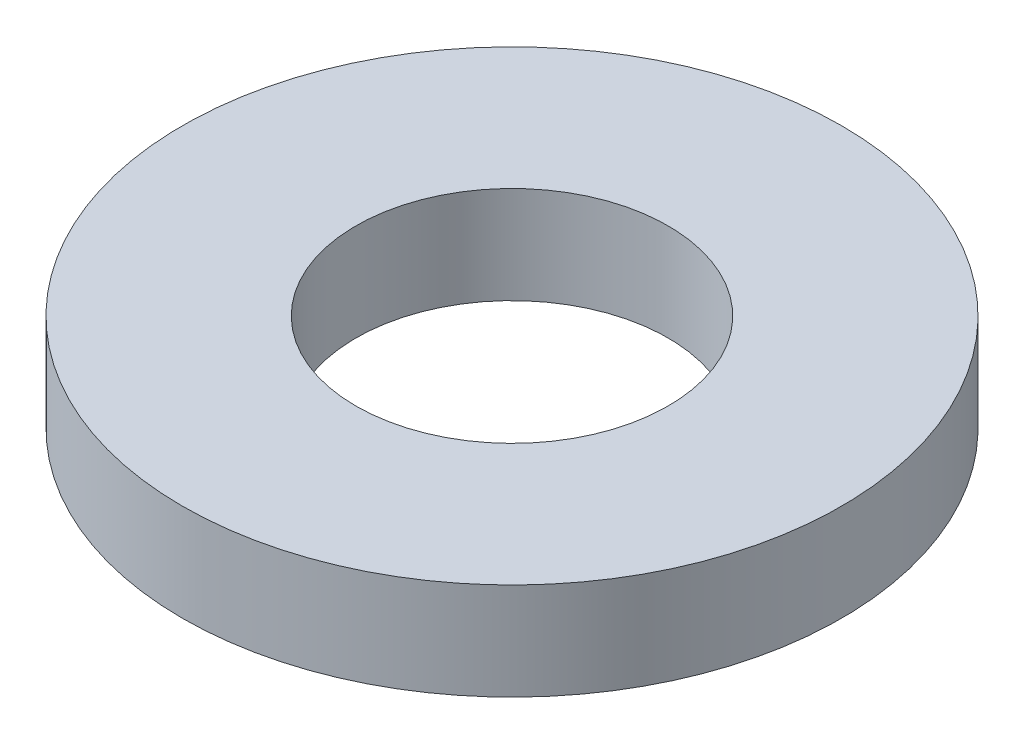
ISO-10303-21;
HEADER;
FILE_DESCRIPTION(('STEP AP214'),'2;1');
FILE_NAME('part.step','',(''),(''),'','','');
FILE_SCHEMA(('AUTOMOTIVE_DESIGN { 1 0 10303 214 1 1 1 1 }'));
ENDSEC;
DATA;
#1=APPLICATION_CONTEXT('core data for automotive mechanical design processes');
#2=APPLICATION_PROTOCOL_DEFINITION('international standard','automotive_design',2000,#1);
#3=PRODUCT_CONTEXT('',#1,'mechanical');
#4=PRODUCT('Part','Part','',(#3));
#5=PRODUCT_RELATED_PRODUCT_CATEGORY('part','',(#4));
#6=PRODUCT_DEFINITION_FORMATION('','',#4);
#7=PRODUCT_DEFINITION_CONTEXT('part definition',#1,'design');
#8=PRODUCT_DEFINITION('design','',#6,#7);
#9=PRODUCT_DEFINITION_SHAPE('','',#8);
#10=(LENGTH_UNIT() NAMED_UNIT(*) SI_UNIT(.MILLI.,.METRE.));
#11=(NAMED_UNIT(*) PLANE_ANGLE_UNIT() SI_UNIT($,.RADIAN.));
#12=(NAMED_UNIT(*) SI_UNIT($,.STERADIAN.) SOLID_ANGLE_UNIT());
#13=UNCERTAINTY_MEASURE_WITH_UNIT(LENGTH_MEASURE(1.E-05),#10,'distance_accuracy_value','');
#14=(GEOMETRIC_REPRESENTATION_CONTEXT(3) GLOBAL_UNCERTAINTY_ASSIGNED_CONTEXT((#13)) GLOBAL_UNIT_ASSIGNED_CONTEXT((#10,
#11,#12)) REPRESENTATION_CONTEXT('',''));
#15=CARTESIAN_POINT('',(0.,0.,0.));
#16=DIRECTION('',(0.,0.,1.));
#17=DIRECTION('',(1.,0.,0.));
#18=AXIS2_PLACEMENT_3D('',#15,#16,#17);
#19=CARTESIAN_POINT('',(0.,14.,0.));
#20=DIRECTION('',(0.,-1.,0.));
#21=DIRECTION('',(0.,0.,-1.));
#22=AXIS2_PLACEMENT_3D('',#19,#20,#21);
#23=CYLINDRICAL_SURFACE('',#22,47.5);
#24=CARTESIAN_POINT('',(0.,14.,0.));
#25=DIRECTION('',(0.,1.,0.));
#26=DIRECTION('',(0.,0.,1.));
#27=AXIS2_PLACEMENT_3D('',#24,#25,#26);
#28=CIRCLE('',#27,47.5);
#29=CARTESIAN_POINT('',(0.,14.,47.5));
#30=VERTEX_POINT('',#29);
#31=EDGE_CURVE('E10',#30,#30,#28,.T.);
#32=ORIENTED_EDGE('',*,*,#31,.F.);
#33=EDGE_LOOP('',(#32));
#34=FACE_BOUND('',#33,.T.);
#35=CARTESIAN_POINT('',(0.,0.,0.));
#36=DIRECTION('',(0.,1.,0.));
#37=DIRECTION('',(0.,0.,1.));
#38=AXIS2_PLACEMENT_3D('',#35,#36,#37);
#39=CIRCLE('',#38,47.5);
#40=CARTESIAN_POINT('',(0.,0.,47.5));
#41=VERTEX_POINT('',#40);
#42=EDGE_CURVE('E37',#41,#41,#39,.T.);
#43=ORIENTED_EDGE('',*,*,#42,.T.);
#44=EDGE_LOOP('',(#43));
#45=FACE_BOUND('',#44,.T.);
#46=ADVANCED_FACE('F40',(#34,#45),#23,.T.);
#47=CARTESIAN_POINT('',(0.,14.,0.));
#48=DIRECTION('',(0.,1.,0.));
#49=DIRECTION('',(0.,0.,1.));
#50=AXIS2_PLACEMENT_3D('',#47,#48,#49);
#51=PLANE('',#50);
#52=CARTESIAN_POINT('',(0.,14.,0.));
#53=DIRECTION('',(0.,1.,0.));
#54=DIRECTION('',(0.,0.,1.));
#55=AXIS2_PLACEMENT_3D('',#52,#53,#54);
#56=CIRCLE('',#55,22.5);
#57=CARTESIAN_POINT('',(0.,14.,22.5));
#58=VERTEX_POINT('',#57);
#59=EDGE_CURVE('E50',#58,#58,#56,.T.);
#60=ORIENTED_EDGE('',*,*,#59,.F.);
#61=EDGE_LOOP('',(#60));
#62=FACE_BOUND('',#61,.T.);
#63=ORIENTED_EDGE('',*,*,#31,.T.);
#64=EDGE_LOOP('',(#63));
#65=FACE_BOUND('',#64,.T.);
#66=ADVANCED_FACE('F59',(#62,#65),#51,.T.);
#67=CARTESIAN_POINT('',(0.,0.,0.));
#68=DIRECTION('',(0.,1.,0.));
#69=DIRECTION('',(0.,0.,1.));
#70=AXIS2_PLACEMENT_3D('',#67,#68,#69);
#71=PLANE('',#70);
#72=CARTESIAN_POINT('',(0.,0.,0.));
#73=DIRECTION('',(0.,1.,0.));
#74=DIRECTION('',(0.,0.,1.));
#75=AXIS2_PLACEMENT_3D('',#72,#73,#74);
#76=CIRCLE('',#75,22.5);
#77=CARTESIAN_POINT('',(0.,0.,22.5));
#78=VERTEX_POINT('',#77);
#79=EDGE_CURVE('E47',#78,#78,#76,.T.);
#80=ORIENTED_EDGE('',*,*,#79,.T.);
#81=EDGE_LOOP('',(#80));
#82=FACE_BOUND('',#81,.T.);
#83=ORIENTED_EDGE('',*,*,#42,.F.);
#84=EDGE_LOOP('',(#83));
#85=FACE_BOUND('',#84,.T.);
#86=ADVANCED_FACE('F58',(#82,#85),#71,.F.);
#87=CARTESIAN_POINT('',(0.,14.,0.));
#88=DIRECTION('',(0.,-1.,0.));
#89=DIRECTION('',(0.,0.,-1.));
#90=AXIS2_PLACEMENT_3D('',#87,#88,#89);
#91=CYLINDRICAL_SURFACE('',#90,22.5);
#92=ORIENTED_EDGE('',*,*,#59,.T.);
#93=EDGE_LOOP('',(#92));
#94=FACE_BOUND('',#93,.T.);
#95=ORIENTED_EDGE('',*,*,#79,.F.);
#96=EDGE_LOOP('',(#95));
#97=FACE_BOUND('',#96,.T.);
#98=ADVANCED_FACE('F54',(#94,#97),#91,.F.);
#99=CLOSED_SHELL('',(#46,#66,#86,#98));
#100=MANIFOLD_SOLID_BREP('B2',#99);
#101=ADVANCED_BREP_SHAPE_REPRESENTATION('',(#18,#100),#14);
#102=SHAPE_DEFINITION_REPRESENTATION(#9,#101);
ENDSEC;
END-ISO-10303-21;
